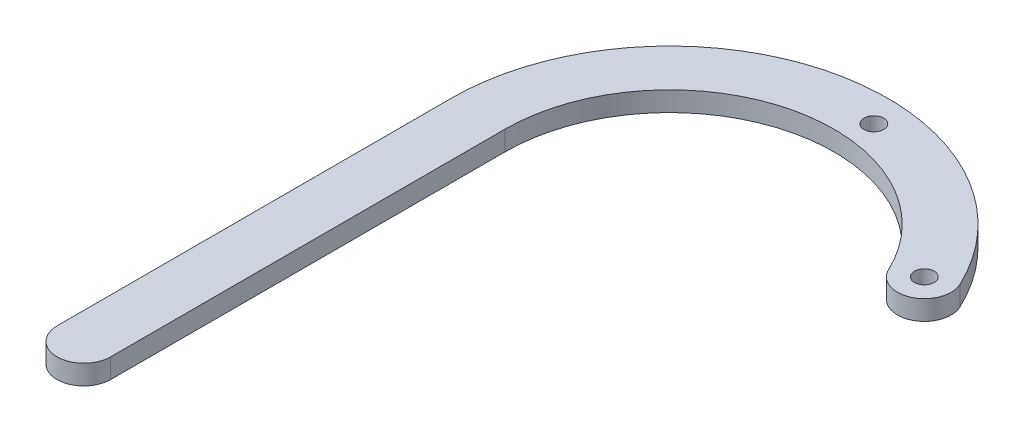
ISO-10303-21;
HEADER;
FILE_DESCRIPTION(('STEP AP214'),'2;1');
FILE_NAME('part.step','',(''),(''),'','','');
FILE_SCHEMA(('AUTOMOTIVE_DESIGN { 1 0 10303 214 1 1 1 1 }'));
ENDSEC;
DATA;
#1=APPLICATION_CONTEXT('core data for automotive mechanical design processes');
#2=APPLICATION_PROTOCOL_DEFINITION('international standard','automotive_design',2000,#1);
#3=PRODUCT_CONTEXT('',#1,'mechanical');
#4=PRODUCT('Part','Part','',(#3));
#5=PRODUCT_RELATED_PRODUCT_CATEGORY('part','',(#4));
#6=PRODUCT_DEFINITION_FORMATION('','',#4);
#7=PRODUCT_DEFINITION_CONTEXT('part definition',#1,'design');
#8=PRODUCT_DEFINITION('design','',#6,#7);
#9=PRODUCT_DEFINITION_SHAPE('','',#8);
#10=(LENGTH_UNIT() NAMED_UNIT(*) SI_UNIT(.MILLI.,.METRE.));
#11=(NAMED_UNIT(*) PLANE_ANGLE_UNIT() SI_UNIT($,.RADIAN.));
#12=(NAMED_UNIT(*) SI_UNIT($,.STERADIAN.) SOLID_ANGLE_UNIT());
#13=UNCERTAINTY_MEASURE_WITH_UNIT(LENGTH_MEASURE(1.E-05),#10,'distance_accuracy_value','');
#14=(GEOMETRIC_REPRESENTATION_CONTEXT(3) GLOBAL_UNCERTAINTY_ASSIGNED_CONTEXT((#13)) GLOBAL_UNIT_ASSIGNED_CONTEXT((#10,
#11,#12)) REPRESENTATION_CONTEXT('',''));
#15=CARTESIAN_POINT('',(0.,0.,0.));
#16=DIRECTION('',(0.,0.,1.));
#17=DIRECTION('',(1.,0.,0.));
#18=AXIS2_PLACEMENT_3D('',#15,#16,#17);
#19=CARTESIAN_POINT('',(-29.3002475229309,3.175,10.7200444291734));
#20=DIRECTION('',(0.,-1.,0.));
#21=DIRECTION('',(0.,0.,-1.));
#22=AXIS2_PLACEMENT_3D('',#19,#20,#21);
#23=CYLINDRICAL_SURFACE('',#22,35.1333119281157);
#24=CARTESIAN_POINT('',(-29.3002475229309,0.,10.7200444291734));
#25=DIRECTION('',(0.,1.,0.));
#26=DIRECTION('',(0.,0.,1.));
#27=AXIS2_PLACEMENT_3D('',#24,#25,#26);
#28=CIRCLE('',#27,35.1333119281157);
#29=CARTESIAN_POINT('',(2.46214320739187,0.,-4.29661772100445));
#30=VERTEX_POINT('',#29);
#31=CARTESIAN_POINT('',(-64.4335594510466,0.,10.7200444291734));
#32=VERTEX_POINT('',#31);
#33=EDGE_CURVE('E117',#30,#32,#28,.T.);
#34=ORIENTED_EDGE('',*,*,#33,.T.);
#35=DIRECTION('',(0.,-1.,0.));
#36=VECTOR('',#35,1.);
#37=CARTESIAN_POINT('',(-64.4335594510466,3.175,10.7200444291734));
#38=LINE('',#37,#36);
#39=CARTESIAN_POINT('',(-64.4335594510466,3.175,10.7200444291734));
#40=VERTEX_POINT('',#39);
#41=EDGE_CURVE('E11',#40,#32,#38,.T.);
#42=ORIENTED_EDGE('',*,*,#41,.F.);
#43=CARTESIAN_POINT('',(-29.3002475229309,3.175,10.7200444291734));
#44=DIRECTION('',(0.,1.,0.));
#45=DIRECTION('',(0.,0.,1.));
#46=AXIS2_PLACEMENT_3D('',#43,#44,#45);
#47=CIRCLE('',#46,35.1333119281157);
#48=CARTESIAN_POINT('',(2.46214320739187,3.175,-4.29661772100445));
#49=VERTEX_POINT('',#48);
#50=EDGE_CURVE('E128',#49,#40,#47,.T.);
#51=ORIENTED_EDGE('',*,*,#50,.F.);
#52=DIRECTION('',(0.,-1.,0.));
#53=VECTOR('',#52,1.);
#54=CARTESIAN_POINT('',(2.46214320739187,3.175,-4.29661772100445));
#55=LINE('',#54,#53);
#56=EDGE_CURVE('E113',#49,#30,#55,.T.);
#57=ORIENTED_EDGE('',*,*,#56,.T.);
#58=EDGE_LOOP('',(#34,#42,#51,#57));
#59=FACE_BOUND('',#58,.T.);
#60=ADVANCED_FACE('F33',(#59),#23,.T.);
#61=CARTESIAN_POINT('',(-64.4335594510466,3.175,10.7200444291734));
#62=DIRECTION('',(1.,0.,0.));
#63=DIRECTION('',(0.,0.,-1.));
#64=AXIS2_PLACEMENT_3D('',#61,#62,#63);
#65=PLANE('',#64);
#66=DIRECTION('',(0.,0.,1.));
#67=VECTOR('',#66,1.);
#68=CARTESIAN_POINT('',(-64.4335594510466,0.,10.7200444291734));
#69=LINE('',#68,#67);
#70=CARTESIAN_POINT('',(-64.4335594510466,0.,74.2200444291734));
#71=VERTEX_POINT('',#70);
#72=EDGE_CURVE('E120',#32,#71,#69,.T.);
#73=ORIENTED_EDGE('',*,*,#72,.T.);
#74=DIRECTION('',(0.,-1.,0.));
#75=VECTOR('',#74,1.);
#76=CARTESIAN_POINT('',(-64.4335594510466,3.175,74.2200444291734));
#77=LINE('',#76,#75);
#78=CARTESIAN_POINT('',(-64.4335594510466,3.175,74.2200444291734));
#79=VERTEX_POINT('',#78);
#80=EDGE_CURVE('E41',#79,#71,#77,.T.);
#81=ORIENTED_EDGE('',*,*,#80,.F.);
#82=DIRECTION('',(0.,0.,1.));
#83=VECTOR('',#82,1.);
#84=CARTESIAN_POINT('',(-64.4335594510466,3.175,10.7200444291734));
#85=LINE('',#84,#83);
#86=EDGE_CURVE('E86',#40,#79,#85,.T.);
#87=ORIENTED_EDGE('',*,*,#86,.F.);
#88=ORIENTED_EDGE('',*,*,#41,.T.);
#89=EDGE_LOOP('',(#73,#81,#87,#88));
#90=FACE_BOUND('',#89,.T.);
#91=ADVANCED_FACE('F153',(#90),#65,.F.);
#92=CARTESIAN_POINT('',(-60.1155594510466,3.175,74.2200444291734));
#93=DIRECTION('',(0.,-1.,0.));
#94=DIRECTION('',(0.,0.,-1.));
#95=AXIS2_PLACEMENT_3D('',#92,#93,#94);
#96=CYLINDRICAL_SURFACE('',#95,4.318);
#97=CARTESIAN_POINT('',(-60.1155594510466,0.,74.2200444291734));
#98=DIRECTION('',(0.,1.,0.));
#99=DIRECTION('',(0.,0.,-1.));
#100=AXIS2_PLACEMENT_3D('',#97,#98,#99);
#101=CIRCLE('',#100,4.318);
#102=CARTESIAN_POINT('',(-55.7975594510466,0.,74.2200444291734));
#103=VERTEX_POINT('',#102);
#104=EDGE_CURVE('E123',#71,#103,#101,.T.);
#105=ORIENTED_EDGE('',*,*,#104,.T.);
#106=DIRECTION('',(0.,-1.,0.));
#107=VECTOR('',#106,1.);
#108=CARTESIAN_POINT('',(-55.7975594510466,3.175,74.2200444291734));
#109=LINE('',#108,#107);
#110=CARTESIAN_POINT('',(-55.7975594510466,3.175,74.2200444291734));
#111=VERTEX_POINT('',#110);
#112=EDGE_CURVE('E108',#111,#103,#109,.T.);
#113=ORIENTED_EDGE('',*,*,#112,.F.);
#114=CARTESIAN_POINT('',(-60.1155594510466,3.175,74.2200444291734));
#115=DIRECTION('',(0.,1.,0.));
#116=DIRECTION('',(0.,0.,-1.));
#117=AXIS2_PLACEMENT_3D('',#114,#115,#116);
#118=CIRCLE('',#117,4.318);
#119=EDGE_CURVE('E99',#79,#111,#118,.T.);
#120=ORIENTED_EDGE('',*,*,#119,.F.);
#121=ORIENTED_EDGE('',*,*,#80,.T.);
#122=EDGE_LOOP('',(#105,#113,#120,#121));
#123=FACE_BOUND('',#122,.T.);
#124=ADVANCED_FACE('F134',(#123),#96,.T.);
#125=CARTESIAN_POINT('',(-55.7975594510466,3.175,10.7200444291734));
#126=DIRECTION('',(-1.,0.,0.));
#127=DIRECTION('',(0.,0.,1.));
#128=AXIS2_PLACEMENT_3D('',#125,#126,#127);
#129=PLANE('',#128);
#130=DIRECTION('',(0.,0.,-1.));
#131=VECTOR('',#130,1.);
#132=CARTESIAN_POINT('',(-55.7975594510466,0.,10.7200444291734));
#133=LINE('',#132,#131);
#134=CARTESIAN_POINT('',(-55.7975594510466,0.,10.7200444291734));
#135=VERTEX_POINT('',#134);
#136=EDGE_CURVE('E107',#103,#135,#133,.T.);
#137=ORIENTED_EDGE('',*,*,#136,.T.);
#138=DIRECTION('',(0.,-1.,0.));
#139=VECTOR('',#138,1.);
#140=CARTESIAN_POINT('',(-55.7975594510466,3.175,10.7200444291734));
#141=LINE('',#140,#139);
#142=CARTESIAN_POINT('',(-55.7975594510466,3.175,10.7200444291734));
#143=VERTEX_POINT('',#142);
#144=EDGE_CURVE('E104',#143,#135,#141,.T.);
#145=ORIENTED_EDGE('',*,*,#144,.F.);
#146=DIRECTION('',(0.,0.,-1.));
#147=VECTOR('',#146,1.);
#148=CARTESIAN_POINT('',(-55.7975594510466,3.175,10.7200444291734));
#149=LINE('',#148,#147);
#150=EDGE_CURVE('E93',#111,#143,#149,.T.);
#151=ORIENTED_EDGE('',*,*,#150,.F.);
#152=ORIENTED_EDGE('',*,*,#112,.T.);
#153=EDGE_LOOP('',(#137,#145,#151,#152));
#154=FACE_BOUND('',#153,.T.);
#155=ADVANCED_FACE('F105',(#154),#129,.F.);
#156=CARTESIAN_POINT('',(-29.3002475229309,3.175,10.7200444291734));
#157=DIRECTION('',(0.,-1.,0.));
#158=DIRECTION('',(0.,0.,-1.));
#159=AXIS2_PLACEMENT_3D('',#156,#157,#158);
#160=CYLINDRICAL_SURFACE('',#159,26.4973119281157);
#161=CARTESIAN_POINT('',(-29.3002475229309,0.,10.7200444291734));
#162=DIRECTION('',(0.,-1.,0.));
#163=DIRECTION('',(0.,0.,1.));
#164=AXIS2_PLACEMENT_3D('',#161,#162,#163);
#165=CIRCLE('',#164,26.4973119281157);
#166=CARTESIAN_POINT('',(-5.34526210948508,0.,-0.605423033914459));
#167=VERTEX_POINT('',#166);
#168=EDGE_CURVE('E72',#135,#167,#165,.T.);
#169=ORIENTED_EDGE('',*,*,#168,.T.);
#170=DIRECTION('',(0.,-1.,0.));
#171=VECTOR('',#170,1.);
#172=CARTESIAN_POINT('',(-5.34526210948508,3.175,-0.605423033914459));
#173=LINE('',#172,#171);
#174=CARTESIAN_POINT('',(-5.34526210948508,3.175,-0.605423033914459));
#175=VERTEX_POINT('',#174);
#176=EDGE_CURVE('E109',#175,#167,#173,.T.);
#177=ORIENTED_EDGE('',*,*,#176,.F.);
#178=CARTESIAN_POINT('',(-29.3002475229309,3.175,10.7200444291734));
#179=DIRECTION('',(0.,-1.,0.));
#180=DIRECTION('',(0.,0.,1.));
#181=AXIS2_PLACEMENT_3D('',#178,#179,#180);
#182=CIRCLE('',#181,26.4973119281157);
#183=EDGE_CURVE('E97',#143,#175,#182,.T.);
#184=ORIENTED_EDGE('',*,*,#183,.F.);
#185=ORIENTED_EDGE('',*,*,#144,.T.);
#186=EDGE_LOOP('',(#169,#177,#184,#185));
#187=FACE_BOUND('',#186,.T.);
#188=ADVANCED_FACE('F111',(#187),#160,.F.);
#189=CARTESIAN_POINT('',(-1.44155945104661,3.175,-2.45102037745945));
#190=DIRECTION('',(0.,-1.,0.));
#191=DIRECTION('',(0.,0.,-1.));
#192=AXIS2_PLACEMENT_3D('',#189,#190,#191);
#193=CYLINDRICAL_SURFACE('',#192,4.318);
#194=CARTESIAN_POINT('',(-1.44155945104661,0.,-2.45102037745945));
#195=DIRECTION('',(0.,1.,0.));
#196=DIRECTION('',(0.,0.,-1.));
#197=AXIS2_PLACEMENT_3D('',#194,#195,#196);
#198=CIRCLE('',#197,4.318);
#199=EDGE_CURVE('E78',#167,#30,#198,.T.);
#200=ORIENTED_EDGE('',*,*,#199,.T.);
#201=ORIENTED_EDGE('',*,*,#56,.F.);
#202=CARTESIAN_POINT('',(-1.44155945104661,3.175,-2.45102037745945));
#203=DIRECTION('',(0.,1.,0.));
#204=DIRECTION('',(0.,0.,-1.));
#205=AXIS2_PLACEMENT_3D('',#202,#203,#204);
#206=CIRCLE('',#205,4.318);
#207=EDGE_CURVE('E49',#175,#49,#206,.T.);
#208=ORIENTED_EDGE('',*,*,#207,.F.);
#209=ORIENTED_EDGE('',*,*,#176,.T.);
#210=EDGE_LOOP('',(#200,#201,#208,#209));
#211=FACE_BOUND('',#210,.T.);
#212=ADVANCED_FACE('F141',(#211),#193,.T.);
#213=CARTESIAN_POINT('',(-29.3002475229309,3.175,10.7200444291734));
#214=DIRECTION('',(0.,1.,0.));
#215=DIRECTION('',(0.,0.,1.));
#216=AXIS2_PLACEMENT_3D('',#213,#214,#215);
#217=PLANE('',#216);
#218=CARTESIAN_POINT('',(-1.44155945104661,3.175,-2.45102037745945));
#219=DIRECTION('',(0.,1.,0.));
#220=DIRECTION('',(0.,0.,1.));
#221=AXIS2_PLACEMENT_3D('',#218,#219,#220);
#222=CIRCLE('',#221,1.5875);
#223=CARTESIAN_POINT('',(-1.44155945104661,3.175,-0.863520377459453));
#224=VERTEX_POINT('',#223);
#225=EDGE_CURVE('E219',#224,#224,#222,.T.);
#226=ORIENTED_EDGE('',*,*,#225,.F.);
#227=EDGE_LOOP('',(#226));
#228=FACE_BOUND('',#227,.T.);
#229=CARTESIAN_POINT('',(-26.8415594510466,3.175,-19.7230203774595));
#230=DIRECTION('',(0.,1.,0.));
#231=DIRECTION('',(0.,0.,1.));
#232=AXIS2_PLACEMENT_3D('',#229,#230,#231);
#233=CIRCLE('',#232,1.5875);
#234=CARTESIAN_POINT('',(-26.8415594510466,3.175,-18.1355203774595));
#235=VERTEX_POINT('',#234);
#236=EDGE_CURVE('E221',#235,#235,#233,.T.);
#237=ORIENTED_EDGE('',*,*,#236,.F.);
#238=EDGE_LOOP('',(#237));
#239=FACE_BOUND('',#238,.T.);
#240=ORIENTED_EDGE('',*,*,#50,.T.);
#241=ORIENTED_EDGE('',*,*,#86,.T.);
#242=ORIENTED_EDGE('',*,*,#119,.T.);
#243=ORIENTED_EDGE('',*,*,#150,.T.);
#244=ORIENTED_EDGE('',*,*,#183,.T.);
#245=ORIENTED_EDGE('',*,*,#207,.T.);
#246=EDGE_LOOP('',(#240,#241,#242,#243,#244,#245));
#247=FACE_BOUND('',#246,.T.);
#248=ADVANCED_FACE('F95',(#228,#239,#247),#217,.T.);
#249=CARTESIAN_POINT('',(-29.3002475229309,0.,10.7200444291734));
#250=DIRECTION('',(0.,1.,0.));
#251=DIRECTION('',(0.,0.,1.));
#252=AXIS2_PLACEMENT_3D('',#249,#250,#251);
#253=PLANE('',#252);
#254=CARTESIAN_POINT('',(-1.44155945104661,0.,-2.45102037745945));
#255=DIRECTION('',(0.,1.,0.));
#256=DIRECTION('',(0.,0.,1.));
#257=AXIS2_PLACEMENT_3D('',#254,#255,#256);
#258=CIRCLE('',#257,1.5875);
#259=CARTESIAN_POINT('',(-1.44155945104661,0.,-0.863520377459453));
#260=VERTEX_POINT('',#259);
#261=EDGE_CURVE('E216',#260,#260,#258,.T.);
#262=ORIENTED_EDGE('',*,*,#261,.T.);
#263=EDGE_LOOP('',(#262));
#264=FACE_BOUND('',#263,.T.);
#265=CARTESIAN_POINT('',(-26.8415594510466,0.,-19.7230203774595));
#266=DIRECTION('',(0.,1.,0.));
#267=DIRECTION('',(0.,0.,1.));
#268=AXIS2_PLACEMENT_3D('',#265,#266,#267);
#269=CIRCLE('',#268,1.5875);
#270=CARTESIAN_POINT('',(-26.8415594510466,0.,-18.1355203774595));
#271=VERTEX_POINT('',#270);
#272=EDGE_CURVE('E121',#271,#271,#269,.T.);
#273=ORIENTED_EDGE('',*,*,#272,.T.);
#274=EDGE_LOOP('',(#273));
#275=FACE_BOUND('',#274,.T.);
#276=ORIENTED_EDGE('',*,*,#33,.F.);
#277=ORIENTED_EDGE('',*,*,#199,.F.);
#278=ORIENTED_EDGE('',*,*,#168,.F.);
#279=ORIENTED_EDGE('',*,*,#136,.F.);
#280=ORIENTED_EDGE('',*,*,#104,.F.);
#281=ORIENTED_EDGE('',*,*,#72,.F.);
#282=EDGE_LOOP('',(#276,#277,#278,#279,#280,#281));
#283=FACE_BOUND('',#282,.T.);
#284=ADVANCED_FACE('F137',(#264,#275,#283),#253,.F.);
#285=CARTESIAN_POINT('',(-26.8415594510466,0.,-19.7230203774595));
#286=DIRECTION('',(0.,1.,0.));
#287=DIRECTION('',(0.,0.,1.));
#288=AXIS2_PLACEMENT_3D('',#285,#286,#287);
#289=CYLINDRICAL_SURFACE('',#288,1.5875);
#290=ORIENTED_EDGE('',*,*,#272,.F.);
#291=EDGE_LOOP('',(#290));
#292=FACE_BOUND('',#291,.T.);
#293=ORIENTED_EDGE('',*,*,#236,.T.);
#294=EDGE_LOOP('',(#293));
#295=FACE_BOUND('',#294,.T.);
#296=ADVANCED_FACE('F190',(#292,#295),#289,.F.);
#297=CARTESIAN_POINT('',(-1.44155945104661,0.,-2.45102037745945));
#298=DIRECTION('',(0.,1.,0.));
#299=DIRECTION('',(0.,0.,1.));
#300=AXIS2_PLACEMENT_3D('',#297,#298,#299);
#301=CYLINDRICAL_SURFACE('',#300,1.5875);
#302=ORIENTED_EDGE('',*,*,#261,.F.);
#303=EDGE_LOOP('',(#302));
#304=FACE_BOUND('',#303,.T.);
#305=ORIENTED_EDGE('',*,*,#225,.T.);
#306=EDGE_LOOP('',(#305));
#307=FACE_BOUND('',#306,.T.);
#308=ADVANCED_FACE('F199',(#304,#307),#301,.F.);
#309=CLOSED_SHELL('',(#60,#91,#124,#155,#188,#212,#248,#284,#296,#308));
#310=MANIFOLD_SOLID_BREP('B2',#309);
#311=ADVANCED_BREP_SHAPE_REPRESENTATION('',(#18,#310),#14);
#312=SHAPE_DEFINITION_REPRESENTATION(#9,#311);
ENDSEC;
END-ISO-10303-21;
